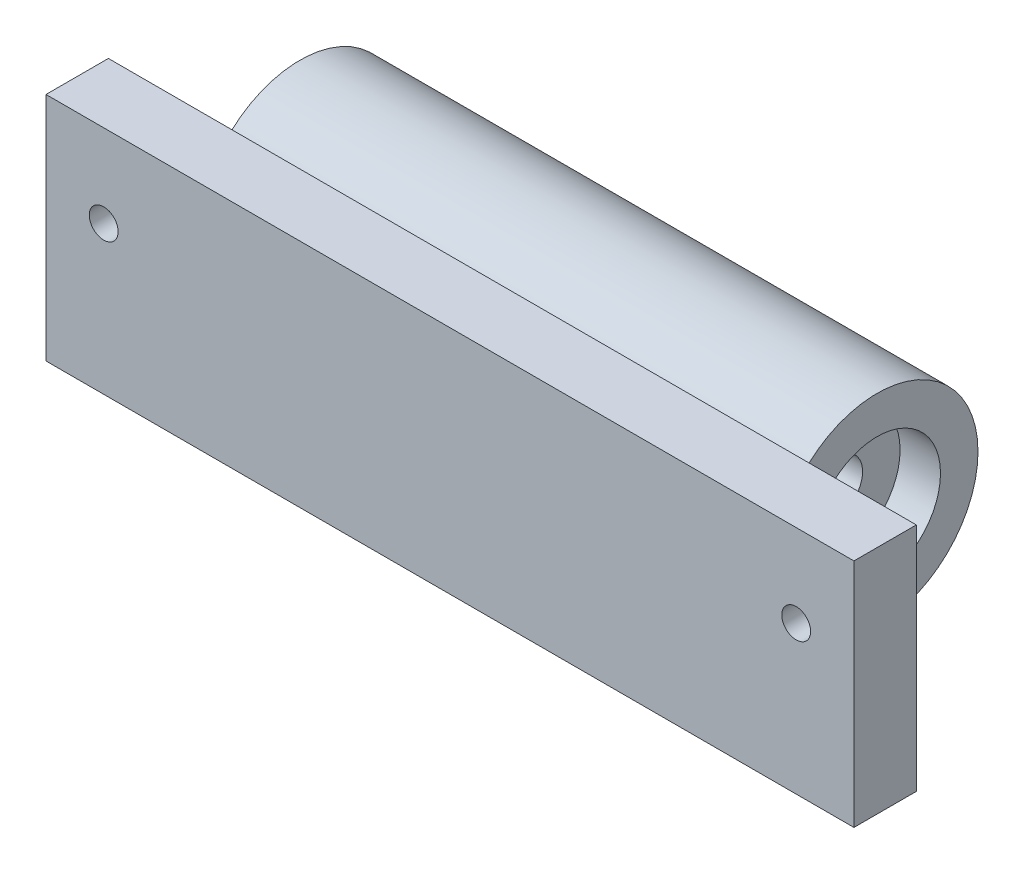
ISO-10303-21;
HEADER;
FILE_DESCRIPTION(('STEP AP214'),'2;1');
FILE_NAME('part.step','',(''),(''),'','','');
FILE_SCHEMA(('AUTOMOTIVE_DESIGN { 1 0 10303 214 1 1 1 1 }'));
ENDSEC;
DATA;
#1=APPLICATION_CONTEXT('core data for automotive mechanical design processes');
#2=APPLICATION_PROTOCOL_DEFINITION('international standard','automotive_design',2000,#1);
#3=PRODUCT_CONTEXT('',#1,'mechanical');
#4=PRODUCT('Part','Part','',(#3));
#5=PRODUCT_RELATED_PRODUCT_CATEGORY('part','',(#4));
#6=PRODUCT_DEFINITION_FORMATION('','',#4);
#7=PRODUCT_DEFINITION_CONTEXT('part definition',#1,'design');
#8=PRODUCT_DEFINITION('design','',#6,#7);
#9=PRODUCT_DEFINITION_SHAPE('','',#8);
#10=(LENGTH_UNIT() NAMED_UNIT(*) SI_UNIT(.MILLI.,.METRE.));
#11=(NAMED_UNIT(*) PLANE_ANGLE_UNIT() SI_UNIT($,.RADIAN.));
#12=(NAMED_UNIT(*) SI_UNIT($,.STERADIAN.) SOLID_ANGLE_UNIT());
#13=UNCERTAINTY_MEASURE_WITH_UNIT(LENGTH_MEASURE(1.E-05),#10,'distance_accuracy_value','');
#14=(GEOMETRIC_REPRESENTATION_CONTEXT(3) GLOBAL_UNCERTAINTY_ASSIGNED_CONTEXT((#13)) GLOBAL_UNIT_ASSIGNED_CONTEXT((#10,
#11,#12)) REPRESENTATION_CONTEXT('',''));
#15=CARTESIAN_POINT('',(0.,0.,0.));
#16=DIRECTION('',(0.,0.,1.));
#17=DIRECTION('',(1.,0.,0.));
#18=AXIS2_PLACEMENT_3D('',#15,#16,#17);
#19=CARTESIAN_POINT('',(100.,0.,0.));
#20=DIRECTION('',(-1.,0.,0.));
#21=DIRECTION('',(0.,0.,1.));
#22=AXIS2_PLACEMENT_3D('',#19,#20,#21);
#23=CYLINDRICAL_SURFACE('',#22,4.5);
#24=CARTESIAN_POINT('',(93.,0.,0.));
#25=DIRECTION('',(1.,0.,0.));
#26=DIRECTION('',(0.,0.,-1.));
#27=AXIS2_PLACEMENT_3D('',#24,#25,#26);
#28=CIRCLE('',#27,4.5);
#29=CARTESIAN_POINT('',(93.,0.,-4.5));
#30=VERTEX_POINT('',#29);
#31=EDGE_CURVE('E163',#30,#30,#28,.T.);
#32=ORIENTED_EDGE('',*,*,#31,.T.);
#33=EDGE_LOOP('',(#32));
#34=FACE_BOUND('',#33,.T.);
#35=CARTESIAN_POINT('',(7.00000000000001,0.,0.));
#36=DIRECTION('',(-1.,0.,0.));
#37=DIRECTION('',(0.,0.,1.));
#38=AXIS2_PLACEMENT_3D('',#35,#36,#37);
#39=CIRCLE('',#38,4.5);
#40=CARTESIAN_POINT('',(7.00000000000001,0.,4.5));
#41=VERTEX_POINT('',#40);
#42=EDGE_CURVE('E39',#41,#41,#39,.T.);
#43=ORIENTED_EDGE('',*,*,#42,.T.);
#44=EDGE_LOOP('',(#43));
#45=FACE_BOUND('',#44,.T.);
#46=ADVANCED_FACE('F35',(#34,#45),#23,.F.);
#47=CARTESIAN_POINT('',(-10.,0.,24.));
#48=DIRECTION('',(0.,0.,-1.));
#49=DIRECTION('',(-1.,0.,0.));
#50=AXIS2_PLACEMENT_3D('',#47,#48,#49);
#51=CYLINDRICAL_SURFACE('',#50,2.5);
#52=CARTESIAN_POINT('',(-10.,0.,24.));
#53=DIRECTION('',(0.,0.,-1.));
#54=DIRECTION('',(-1.,0.,0.));
#55=AXIS2_PLACEMENT_3D('',#52,#53,#54);
#56=CIRCLE('',#55,2.5);
#57=CARTESIAN_POINT('',(-12.5,0.,24.));
#58=VERTEX_POINT('',#57);
#59=EDGE_CURVE('E111',#58,#58,#56,.T.);
#60=ORIENTED_EDGE('',*,*,#59,.F.);
#61=EDGE_LOOP('',(#60));
#62=FACE_BOUND('',#61,.T.);
#63=CARTESIAN_POINT('',(-10.,0.,18.1888672784065));
#64=DIRECTION('',(0.,0.,-1.));
#65=DIRECTION('',(-1.,0.,0.));
#66=AXIS2_PLACEMENT_3D('',#63,#64,#65);
#67=CIRCLE('',#66,2.5);
#68=CARTESIAN_POINT('',(-12.5,0.,18.1888672784065));
#69=VERTEX_POINT('',#68);
#70=EDGE_CURVE('E159',#69,#69,#67,.F.);
#71=ORIENTED_EDGE('',*,*,#70,.F.);
#72=EDGE_LOOP('',(#71));
#73=FACE_BOUND('',#72,.T.);
#74=ADVANCED_FACE('F192',(#62,#73),#51,.F.);
#75=CARTESIAN_POINT('',(110.,0.,24.));
#76=DIRECTION('',(0.,0.,-1.));
#77=DIRECTION('',(-1.,0.,0.));
#78=AXIS2_PLACEMENT_3D('',#75,#76,#77);
#79=CYLINDRICAL_SURFACE('',#78,2.5);
#80=CARTESIAN_POINT('',(110.,0.,24.));
#81=DIRECTION('',(0.,0.,-1.));
#82=DIRECTION('',(-1.,0.,0.));
#83=AXIS2_PLACEMENT_3D('',#80,#81,#82);
#84=CIRCLE('',#83,2.5);
#85=CARTESIAN_POINT('',(107.5,0.,24.));
#86=VERTEX_POINT('',#85);
#87=EDGE_CURVE('E108',#86,#86,#84,.T.);
#88=ORIENTED_EDGE('',*,*,#87,.F.);
#89=EDGE_LOOP('',(#88));
#90=FACE_BOUND('',#89,.T.);
#91=CARTESIAN_POINT('',(110.,0.,18.1888672784065));
#92=DIRECTION('',(0.,0.,-1.));
#93=DIRECTION('',(-1.,0.,0.));
#94=AXIS2_PLACEMENT_3D('',#91,#92,#93);
#95=CIRCLE('',#94,2.5);
#96=CARTESIAN_POINT('',(107.5,0.,18.1888672784065));
#97=VERTEX_POINT('',#96);
#98=EDGE_CURVE('E155',#97,#97,#95,.F.);
#99=ORIENTED_EDGE('',*,*,#98,.F.);
#100=EDGE_LOOP('',(#99));
#101=FACE_BOUND('',#100,.T.);
#102=ADVANCED_FACE('F195',(#90,#101),#79,.F.);
#103=CARTESIAN_POINT('',(0.,0.,0.));
#104=DIRECTION('',(1.,0.,0.));
#105=DIRECTION('',(0.,0.,-1.));
#106=AXIS2_PLACEMENT_3D('',#103,#104,#105);
#107=PLANE('',#106);
#108=CARTESIAN_POINT('',(0.,0.,0.));
#109=DIRECTION('',(-1.,0.,0.));
#110=DIRECTION('',(0.,0.,1.));
#111=AXIS2_PLACEMENT_3D('',#108,#109,#110);
#112=CIRCLE('',#111,11.);
#113=CARTESIAN_POINT('',(0.,0.,11.));
#114=VERTEX_POINT('',#113);
#115=EDGE_CURVE('E179',#114,#114,#112,.T.);
#116=ORIENTED_EDGE('',*,*,#115,.F.);
#117=EDGE_LOOP('',(#116));
#118=FACE_BOUND('',#117,.T.);
#119=DIRECTION('',(0.,-1.,0.));
#120=VECTOR('',#119,1.);
#121=CARTESIAN_POINT('',(0.,14.3532675787461,13.1888672784065));
#122=LINE('',#121,#120);
#123=CARTESIAN_POINT('',(0.,11.5023380194019,13.1888672784065));
#124=VERTEX_POINT('',#123);
#125=CARTESIAN_POINT('',(0.,-11.5023380194019,13.1888672784065));
#126=VERTEX_POINT('',#125);
#127=EDGE_CURVE('E45',#124,#126,#122,.T.);
#128=ORIENTED_EDGE('',*,*,#127,.F.);
#129=CARTESIAN_POINT('',(0.,0.,0.));
#130=DIRECTION('',(1.,0.,0.));
#131=DIRECTION('',(0.,0.,-1.));
#132=AXIS2_PLACEMENT_3D('',#129,#130,#131);
#133=CIRCLE('',#132,17.5);
#134=EDGE_CURVE('E126',#126,#124,#133,.T.);
#135=ORIENTED_EDGE('',*,*,#134,.F.);
#136=EDGE_LOOP('',(#128,#135));
#137=FACE_BOUND('',#136,.T.);
#138=ADVANCED_FACE('F228',(#118,#137),#107,.F.);
#139=CARTESIAN_POINT('',(100.,0.,0.));
#140=DIRECTION('',(1.,0.,0.));
#141=DIRECTION('',(0.,0.,-1.));
#142=AXIS2_PLACEMENT_3D('',#139,#140,#141);
#143=PLANE('',#142);
#144=CARTESIAN_POINT('',(100.,0.,0.));
#145=DIRECTION('',(1.,0.,0.));
#146=DIRECTION('',(0.,0.,-1.));
#147=AXIS2_PLACEMENT_3D('',#144,#145,#146);
#148=CIRCLE('',#147,11.);
#149=CARTESIAN_POINT('',(100.,0.,-11.));
#150=VERTEX_POINT('',#149);
#151=EDGE_CURVE('E172',#150,#150,#148,.T.);
#152=ORIENTED_EDGE('',*,*,#151,.F.);
#153=EDGE_LOOP('',(#152));
#154=FACE_BOUND('',#153,.T.);
#155=DIRECTION('',(0.,1.,0.));
#156=VECTOR('',#155,1.);
#157=CARTESIAN_POINT('',(100.,14.3532675787461,13.1888672784065));
#158=LINE('',#157,#156);
#159=CARTESIAN_POINT('',(100.,-11.5023380194019,13.1888672784065));
#160=VERTEX_POINT('',#159);
#161=CARTESIAN_POINT('',(100.,11.5023380194019,13.1888672784065));
#162=VERTEX_POINT('',#161);
#163=EDGE_CURVE('E11',#160,#162,#158,.T.);
#164=ORIENTED_EDGE('',*,*,#163,.F.);
#165=CARTESIAN_POINT('',(100.,0.,0.));
#166=DIRECTION('',(1.,0.,0.));
#167=DIRECTION('',(0.,0.,-1.));
#168=AXIS2_PLACEMENT_3D('',#165,#166,#167);
#169=CIRCLE('',#168,17.5);
#170=EDGE_CURVE('E139',#160,#162,#169,.T.);
#171=ORIENTED_EDGE('',*,*,#170,.T.);
#172=EDGE_LOOP('',(#164,#171));
#173=FACE_BOUND('',#172,.T.);
#174=ADVANCED_FACE('F225',(#154,#173),#143,.T.);
#175=CARTESIAN_POINT('',(100.,0.,0.));
#176=DIRECTION('',(-1.,0.,0.));
#177=DIRECTION('',(0.,0.,1.));
#178=AXIS2_PLACEMENT_3D('',#175,#176,#177);
#179=CYLINDRICAL_SURFACE('',#178,17.5);
#180=ORIENTED_EDGE('',*,*,#134,.T.);
#181=DIRECTION('',(-1.,0.,0.));
#182=VECTOR('',#181,1.);
#183=CARTESIAN_POINT('',(100.,11.5023380194019,13.1888672784065));
#184=LINE('',#183,#182);
#185=EDGE_CURVE('E132',#162,#124,#184,.T.);
#186=ORIENTED_EDGE('',*,*,#185,.F.);
#187=ORIENTED_EDGE('',*,*,#170,.F.);
#188=DIRECTION('',(-1.,0.,0.));
#189=VECTOR('',#188,1.);
#190=CARTESIAN_POINT('',(100.,-11.5023380194019,13.1888672784065));
#191=LINE('',#190,#189);
#192=EDGE_CURVE('E127',#160,#126,#191,.T.);
#193=ORIENTED_EDGE('',*,*,#192,.T.);
#194=EDGE_LOOP('',(#180,#186,#187,#193));
#195=FACE_BOUND('',#194,.T.);
#196=ADVANCED_FACE('F37',(#195),#179,.T.);
#197=CARTESIAN_POINT('',(100.,14.3532675787461,24.));
#198=DIRECTION('',(0.,-1.,0.));
#199=DIRECTION('',(0.,0.,-1.));
#200=AXIS2_PLACEMENT_3D('',#197,#198,#199);
#201=PLANE('',#200);
#202=DIRECTION('',(-1.,0.,0.));
#203=VECTOR('',#202,1.);
#204=CARTESIAN_POINT('',(100.,14.3532675787461,13.1888672784065));
#205=LINE('',#204,#203);
#206=CARTESIAN_POINT('',(120.,14.3532675787461,13.1888672784065));
#207=VERTEX_POINT('',#206);
#208=CARTESIAN_POINT('',(-20.,14.3532675787461,13.1888672784065));
#209=VERTEX_POINT('',#208);
#210=EDGE_CURVE('E130',#207,#209,#205,.T.);
#211=ORIENTED_EDGE('',*,*,#210,.T.);
#212=DIRECTION('',(0.,0.,-1.));
#213=VECTOR('',#212,1.);
#214=CARTESIAN_POINT('',(-20.,14.3532675787461,24.));
#215=LINE('',#214,#213);
#216=CARTESIAN_POINT('',(-20.,14.3532675787461,24.));
#217=VERTEX_POINT('',#216);
#218=EDGE_CURVE('E118',#217,#209,#215,.T.);
#219=ORIENTED_EDGE('',*,*,#218,.F.);
#220=DIRECTION('',(-1.,0.,0.));
#221=VECTOR('',#220,1.);
#222=CARTESIAN_POINT('',(100.,14.3532675787461,24.));
#223=LINE('',#222,#221);
#224=CARTESIAN_POINT('',(120.,14.3532675787461,24.));
#225=VERTEX_POINT('',#224);
#226=EDGE_CURVE('E93',#225,#217,#223,.T.);
#227=ORIENTED_EDGE('',*,*,#226,.F.);
#228=DIRECTION('',(0.,0.,1.));
#229=VECTOR('',#228,1.);
#230=CARTESIAN_POINT('',(120.,14.3532675787461,24.));
#231=LINE('',#230,#229);
#232=EDGE_CURVE('E107',#207,#225,#231,.T.);
#233=ORIENTED_EDGE('',*,*,#232,.F.);
#234=EDGE_LOOP('',(#211,#219,#227,#233));
#235=FACE_BOUND('',#234,.T.);
#236=ADVANCED_FACE('F240',(#235),#201,.F.);
#237=CARTESIAN_POINT('',(100.,14.3532675787461,24.));
#238=DIRECTION('',(0.,0.,-1.));
#239=DIRECTION('',(-1.,0.,0.));
#240=AXIS2_PLACEMENT_3D('',#237,#238,#239);
#241=PLANE('',#240);
#242=ORIENTED_EDGE('',*,*,#59,.T.);
#243=EDGE_LOOP('',(#242));
#244=FACE_BOUND('',#243,.T.);
#245=ORIENTED_EDGE('',*,*,#87,.T.);
#246=EDGE_LOOP('',(#245));
#247=FACE_BOUND('',#246,.T.);
#248=ORIENTED_EDGE('',*,*,#226,.T.);
#249=DIRECTION('',(0.,1.,0.));
#250=VECTOR('',#249,1.);
#251=CARTESIAN_POINT('',(-20.,14.3532675787461,24.));
#252=LINE('',#251,#250);
#253=CARTESIAN_POINT('',(-20.,-25.6467324212539,24.));
#254=VERTEX_POINT('',#253);
#255=EDGE_CURVE('E89',#254,#217,#252,.T.);
#256=ORIENTED_EDGE('',*,*,#255,.F.);
#257=DIRECTION('',(-1.,0.,0.));
#258=VECTOR('',#257,1.);
#259=CARTESIAN_POINT('',(100.,-25.6467324212539,24.));
#260=LINE('',#259,#258);
#261=CARTESIAN_POINT('',(120.,-25.6467324212539,24.));
#262=VERTEX_POINT('',#261);
#263=EDGE_CURVE('E83',#262,#254,#260,.T.);
#264=ORIENTED_EDGE('',*,*,#263,.F.);
#265=DIRECTION('',(0.,-1.,0.));
#266=VECTOR('',#265,1.);
#267=CARTESIAN_POINT('',(120.,14.3532675787461,24.));
#268=LINE('',#267,#266);
#269=EDGE_CURVE('E87',#225,#262,#268,.T.);
#270=ORIENTED_EDGE('',*,*,#269,.F.);
#271=EDGE_LOOP('',(#248,#256,#264,#270));
#272=FACE_BOUND('',#271,.T.);
#273=ADVANCED_FACE('F85',(#244,#247,#272),#241,.F.);
#274=CARTESIAN_POINT('',(100.,-25.6467324212539,24.));
#275=DIRECTION('',(0.,1.,0.));
#276=DIRECTION('',(0.,0.,1.));
#277=AXIS2_PLACEMENT_3D('',#274,#275,#276);
#278=PLANE('',#277);
#279=ORIENTED_EDGE('',*,*,#263,.T.);
#280=DIRECTION('',(0.,0.,1.));
#281=VECTOR('',#280,1.);
#282=CARTESIAN_POINT('',(-20.,-25.6467324212539,24.));
#283=LINE('',#282,#281);
#284=CARTESIAN_POINT('',(-20.,-25.6467324212539,13.1888672784065));
#285=VERTEX_POINT('',#284);
#286=EDGE_CURVE('E124',#285,#254,#283,.T.);
#287=ORIENTED_EDGE('',*,*,#286,.F.);
#288=DIRECTION('',(-1.,0.,0.));
#289=VECTOR('',#288,1.);
#290=CARTESIAN_POINT('',(100.,-25.6467324212539,13.1888672784065));
#291=LINE('',#290,#289);
#292=CARTESIAN_POINT('',(120.,-25.6467324212539,13.1888672784065));
#293=VERTEX_POINT('',#292);
#294=EDGE_CURVE('E94',#293,#285,#291,.T.);
#295=ORIENTED_EDGE('',*,*,#294,.F.);
#296=DIRECTION('',(0.,0.,-1.));
#297=VECTOR('',#296,1.);
#298=CARTESIAN_POINT('',(120.,-25.6467324212539,24.));
#299=LINE('',#298,#297);
#300=EDGE_CURVE('E97',#262,#293,#299,.T.);
#301=ORIENTED_EDGE('',*,*,#300,.F.);
#302=EDGE_LOOP('',(#279,#287,#295,#301));
#303=FACE_BOUND('',#302,.T.);
#304=ADVANCED_FACE('F98',(#303),#278,.F.);
#305=CARTESIAN_POINT('',(100.,-11.5023380194019,13.1888672784065));
#306=DIRECTION('',(0.,0.,1.));
#307=DIRECTION('',(0.,-1.,0.));
#308=AXIS2_PLACEMENT_3D('',#305,#306,#307);
#309=PLANE('',#308);
#310=CARTESIAN_POINT('',(-10.,0.,13.1888672784065));
#311=DIRECTION('',(0.,0.,-1.));
#312=DIRECTION('',(-1.,0.,0.));
#313=AXIS2_PLACEMENT_3D('',#310,#311,#312);
#314=CIRCLE('',#313,4.25);
#315=CARTESIAN_POINT('',(-14.25,0.,13.1888672784065));
#316=VERTEX_POINT('',#315);
#317=EDGE_CURVE('E165',#316,#316,#314,.T.);
#318=ORIENTED_EDGE('',*,*,#317,.F.);
#319=EDGE_LOOP('',(#318));
#320=FACE_BOUND('',#319,.T.);
#321=CARTESIAN_POINT('',(110.,0.,13.1888672784065));
#322=DIRECTION('',(0.,0.,-1.));
#323=DIRECTION('',(-1.,0.,0.));
#324=AXIS2_PLACEMENT_3D('',#321,#322,#323);
#325=CIRCLE('',#324,4.25000000000001);
#326=CARTESIAN_POINT('',(105.75,0.,13.1888672784065));
#327=VERTEX_POINT('',#326);
#328=EDGE_CURVE('E161',#327,#327,#325,.T.);
#329=ORIENTED_EDGE('',*,*,#328,.F.);
#330=EDGE_LOOP('',(#329));
#331=FACE_BOUND('',#330,.T.);
#332=ORIENTED_EDGE('',*,*,#192,.F.);
#333=ORIENTED_EDGE('',*,*,#163,.T.);
#334=ORIENTED_EDGE('',*,*,#185,.T.);
#335=ORIENTED_EDGE('',*,*,#127,.T.);
#336=EDGE_LOOP('',(#332,#333,#334,#335));
#337=FACE_BOUND('',#336,.T.);
#338=ORIENTED_EDGE('',*,*,#294,.T.);
#339=DIRECTION('',(0.,-1.,0.));
#340=VECTOR('',#339,1.);
#341=CARTESIAN_POINT('',(-20.,14.3532675787461,13.1888672784065));
#342=LINE('',#341,#340);
#343=EDGE_CURVE('E121',#209,#285,#342,.T.);
#344=ORIENTED_EDGE('',*,*,#343,.F.);
#345=ORIENTED_EDGE('',*,*,#210,.F.);
#346=DIRECTION('',(0.,1.,0.));
#347=VECTOR('',#346,1.);
#348=CARTESIAN_POINT('',(120.,14.3532675787461,13.1888672784065));
#349=LINE('',#348,#347);
#350=EDGE_CURVE('E102',#293,#207,#349,.T.);
#351=ORIENTED_EDGE('',*,*,#350,.F.);
#352=EDGE_LOOP('',(#338,#344,#345,#351));
#353=FACE_BOUND('',#352,.T.);
#354=ADVANCED_FACE('F233',(#320,#331,#337,#353),#309,.F.);
#355=CARTESIAN_POINT('',(-20.,0.,0.));
#356=DIRECTION('',(1.,0.,0.));
#357=DIRECTION('',(0.,0.,-1.));
#358=AXIS2_PLACEMENT_3D('',#355,#356,#357);
#359=PLANE('',#358);
#360=ORIENTED_EDGE('',*,*,#255,.T.);
#361=ORIENTED_EDGE('',*,*,#218,.T.);
#362=ORIENTED_EDGE('',*,*,#343,.T.);
#363=ORIENTED_EDGE('',*,*,#286,.T.);
#364=EDGE_LOOP('',(#360,#361,#362,#363));
#365=FACE_BOUND('',#364,.T.);
#366=ADVANCED_FACE('F223',(#365),#359,.F.);
#367=CARTESIAN_POINT('',(120.,0.,0.));
#368=DIRECTION('',(1.,0.,0.));
#369=DIRECTION('',(0.,0.,-1.));
#370=AXIS2_PLACEMENT_3D('',#367,#368,#369);
#371=PLANE('',#370);
#372=ORIENTED_EDGE('',*,*,#269,.T.);
#373=ORIENTED_EDGE('',*,*,#300,.T.);
#374=ORIENTED_EDGE('',*,*,#350,.T.);
#375=ORIENTED_EDGE('',*,*,#232,.T.);
#376=EDGE_LOOP('',(#372,#373,#374,#375));
#377=FACE_BOUND('',#376,.T.);
#378=ADVANCED_FACE('F105',(#377),#371,.T.);
#379=CARTESIAN_POINT('',(110.,0.,18.1888672784065));
#380=DIRECTION('',(0.,0.,-1.));
#381=DIRECTION('',(-1.,0.,0.));
#382=AXIS2_PLACEMENT_3D('',#379,#380,#381);
#383=PLANE('',#382);
#384=CARTESIAN_POINT('',(110.,0.,18.1888672784065));
#385=DIRECTION('',(0.,0.,-1.));
#386=DIRECTION('',(-1.,0.,0.));
#387=AXIS2_PLACEMENT_3D('',#384,#385,#386);
#388=CIRCLE('',#387,4.25000000000001);
#389=CARTESIAN_POINT('',(105.75,0.,18.1888672784065));
#390=VERTEX_POINT('',#389);
#391=EDGE_CURVE('E158',#390,#390,#388,.T.);
#392=ORIENTED_EDGE('',*,*,#391,.T.);
#393=EDGE_LOOP('',(#392));
#394=FACE_BOUND('',#393,.T.);
#395=ORIENTED_EDGE('',*,*,#98,.T.);
#396=EDGE_LOOP('',(#395));
#397=FACE_BOUND('',#396,.T.);
#398=ADVANCED_FACE('F212',(#394,#397),#383,.T.);
#399=CARTESIAN_POINT('',(110.,0.,18.1888672784065));
#400=DIRECTION('',(0.,0.,-1.));
#401=DIRECTION('',(-1.,0.,0.));
#402=AXIS2_PLACEMENT_3D('',#399,#400,#401);
#403=CYLINDRICAL_SURFACE('',#402,4.25000000000001);
#404=ORIENTED_EDGE('',*,*,#391,.F.);
#405=EDGE_LOOP('',(#404));
#406=FACE_BOUND('',#405,.T.);
#407=ORIENTED_EDGE('',*,*,#328,.T.);
#408=EDGE_LOOP('',(#407));
#409=FACE_BOUND('',#408,.T.);
#410=ADVANCED_FACE('F202',(#406,#409),#403,.F.);
#411=CARTESIAN_POINT('',(-10.,0.,18.1888672784065));
#412=DIRECTION('',(0.,0.,-1.));
#413=DIRECTION('',(-1.,0.,0.));
#414=AXIS2_PLACEMENT_3D('',#411,#412,#413);
#415=PLANE('',#414);
#416=CARTESIAN_POINT('',(-10.,0.,18.1888672784065));
#417=DIRECTION('',(0.,0.,-1.));
#418=DIRECTION('',(-1.,0.,0.));
#419=AXIS2_PLACEMENT_3D('',#416,#417,#418);
#420=CIRCLE('',#419,4.25);
#421=CARTESIAN_POINT('',(-14.25,0.,18.1888672784065));
#422=VERTEX_POINT('',#421);
#423=EDGE_CURVE('E162',#422,#422,#420,.T.);
#424=ORIENTED_EDGE('',*,*,#423,.T.);
#425=EDGE_LOOP('',(#424));
#426=FACE_BOUND('',#425,.T.);
#427=ORIENTED_EDGE('',*,*,#70,.T.);
#428=EDGE_LOOP('',(#427));
#429=FACE_BOUND('',#428,.T.);
#430=ADVANCED_FACE('F199',(#426,#429),#415,.T.);
#431=CARTESIAN_POINT('',(-10.,0.,18.1888672784065));
#432=DIRECTION('',(0.,0.,-1.));
#433=DIRECTION('',(-1.,0.,0.));
#434=AXIS2_PLACEMENT_3D('',#431,#432,#433);
#435=CYLINDRICAL_SURFACE('',#434,4.25);
#436=ORIENTED_EDGE('',*,*,#423,.F.);
#437=EDGE_LOOP('',(#436));
#438=FACE_BOUND('',#437,.T.);
#439=ORIENTED_EDGE('',*,*,#317,.T.);
#440=EDGE_LOOP('',(#439));
#441=FACE_BOUND('',#440,.T.);
#442=ADVANCED_FACE('F201',(#438,#441),#435,.F.);
#443=CARTESIAN_POINT('',(93.,0.,0.));
#444=DIRECTION('',(1.,0.,0.));
#445=DIRECTION('',(0.,0.,-1.));
#446=AXIS2_PLACEMENT_3D('',#443,#444,#445);
#447=CYLINDRICAL_SURFACE('',#446,11.);
#448=CARTESIAN_POINT('',(93.,0.,0.));
#449=DIRECTION('',(1.,0.,0.));
#450=DIRECTION('',(0.,0.,-1.));
#451=AXIS2_PLACEMENT_3D('',#448,#449,#450);
#452=CIRCLE('',#451,11.);
#453=CARTESIAN_POINT('',(93.,0.,-11.));
#454=VERTEX_POINT('',#453);
#455=EDGE_CURVE('E166',#454,#454,#452,.T.);
#456=ORIENTED_EDGE('',*,*,#455,.F.);
#457=EDGE_LOOP('',(#456));
#458=FACE_BOUND('',#457,.T.);
#459=ORIENTED_EDGE('',*,*,#151,.T.);
#460=EDGE_LOOP('',(#459));
#461=FACE_BOUND('',#460,.T.);
#462=ADVANCED_FACE('F209',(#458,#461),#447,.F.);
#463=CARTESIAN_POINT('',(93.,0.,0.));
#464=DIRECTION('',(1.,0.,0.));
#465=DIRECTION('',(0.,0.,-1.));
#466=AXIS2_PLACEMENT_3D('',#463,#464,#465);
#467=PLANE('',#466);
#468=ORIENTED_EDGE('',*,*,#31,.F.);
#469=EDGE_LOOP('',(#468));
#470=FACE_BOUND('',#469,.T.);
#471=ORIENTED_EDGE('',*,*,#455,.T.);
#472=EDGE_LOOP('',(#471));
#473=FACE_BOUND('',#472,.T.);
#474=ADVANCED_FACE('F347',(#470,#473),#467,.T.);
#475=CARTESIAN_POINT('',(7.,0.,0.));
#476=DIRECTION('',(-1.,0.,0.));
#477=DIRECTION('',(0.,0.,1.));
#478=AXIS2_PLACEMENT_3D('',#475,#476,#477);
#479=CYLINDRICAL_SURFACE('',#478,11.);
#480=CARTESIAN_POINT('',(7.,0.,0.));
#481=DIRECTION('',(-1.,0.,0.));
#482=DIRECTION('',(0.,0.,1.));
#483=AXIS2_PLACEMENT_3D('',#480,#481,#482);
#484=CIRCLE('',#483,11.);
#485=CARTESIAN_POINT('',(7.,0.,11.));
#486=VERTEX_POINT('',#485);
#487=EDGE_CURVE('E388',#486,#486,#484,.T.);
#488=ORIENTED_EDGE('',*,*,#487,.F.);
#489=EDGE_LOOP('',(#488));
#490=FACE_BOUND('',#489,.T.);
#491=ORIENTED_EDGE('',*,*,#115,.T.);
#492=EDGE_LOOP('',(#491));
#493=FACE_BOUND('',#492,.T.);
#494=ADVANCED_FACE('F355',(#490,#493),#479,.F.);
#495=CARTESIAN_POINT('',(7.,0.,0.));
#496=DIRECTION('',(-1.,0.,0.));
#497=DIRECTION('',(0.,0.,1.));
#498=AXIS2_PLACEMENT_3D('',#495,#496,#497);
#499=PLANE('',#498);
#500=ORIENTED_EDGE('',*,*,#42,.F.);
#501=EDGE_LOOP('',(#500));
#502=FACE_BOUND('',#501,.T.);
#503=ORIENTED_EDGE('',*,*,#487,.T.);
#504=EDGE_LOOP('',(#503));
#505=FACE_BOUND('',#504,.T.);
#506=ADVANCED_FACE('F367',(#502,#505),#499,.T.);
#507=CLOSED_SHELL('',(#46,#74,#102,#138,#174,#196,#236,#273,#304,#354,#366,#378,#398,#410,#430,
#442,#462,#474,#494,#506));
#508=MANIFOLD_SOLID_BREP('B2',#507);
#509=ADVANCED_BREP_SHAPE_REPRESENTATION('',(#18,#508),#14);
#510=SHAPE_DEFINITION_REPRESENTATION(#9,#509);
ENDSEC;
END-ISO-10303-21;
